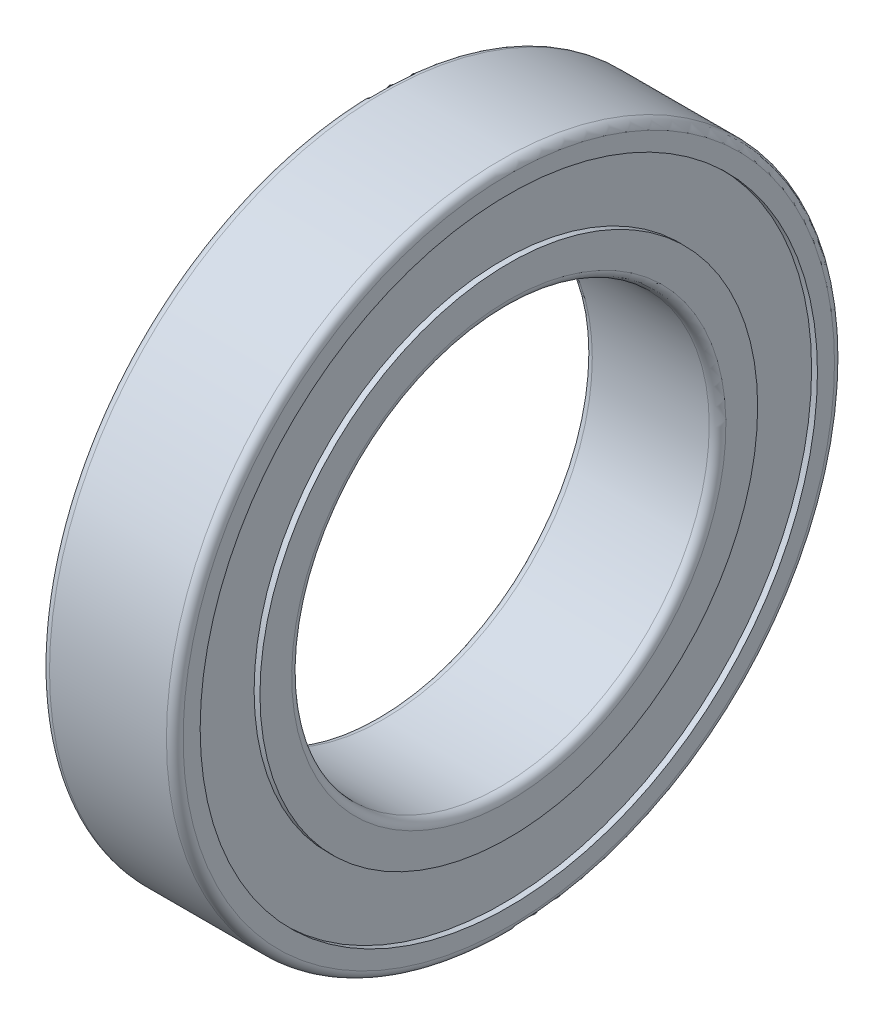
ISO-10303-21;
HEADER;
FILE_DESCRIPTION(('STEP AP214'),'2;1');
FILE_NAME('part.step','',(''),(''),'','','');
FILE_SCHEMA(('AUTOMOTIVE_DESIGN { 1 0 10303 214 1 1 1 1 }'));
ENDSEC;
DATA;
#1=APPLICATION_CONTEXT('core data for automotive mechanical design processes');
#2=APPLICATION_PROTOCOL_DEFINITION('international standard','automotive_design',2000,#1);
#3=PRODUCT_CONTEXT('',#1,'mechanical');
#4=PRODUCT('Part','Part','',(#3));
#5=PRODUCT_RELATED_PRODUCT_CATEGORY('part','',(#4));
#6=PRODUCT_DEFINITION_FORMATION('','',#4);
#7=PRODUCT_DEFINITION_CONTEXT('part definition',#1,'design');
#8=PRODUCT_DEFINITION('design','',#6,#7);
#9=PRODUCT_DEFINITION_SHAPE('','',#8);
#10=(LENGTH_UNIT() NAMED_UNIT(*) SI_UNIT(.MILLI.,.METRE.));
#11=(NAMED_UNIT(*) PLANE_ANGLE_UNIT() SI_UNIT($,.RADIAN.));
#12=(NAMED_UNIT(*) SI_UNIT($,.STERADIAN.) SOLID_ANGLE_UNIT());
#13=UNCERTAINTY_MEASURE_WITH_UNIT(LENGTH_MEASURE(1.E-05),#10,'distance_accuracy_value','');
#14=(GEOMETRIC_REPRESENTATION_CONTEXT(3) GLOBAL_UNCERTAINTY_ASSIGNED_CONTEXT((#13)) GLOBAL_UNIT_ASSIGNED_CONTEXT((#10,
#11,#12)) REPRESENTATION_CONTEXT('',''));
#15=CARTESIAN_POINT('',(0.,0.,0.));
#16=DIRECTION('',(0.,0.,1.));
#17=DIRECTION('',(1.,0.,0.));
#18=AXIS2_PLACEMENT_3D('',#15,#16,#17);
#19=CARTESIAN_POINT('',(16.,0.,0.));
#20=DIRECTION('',(-1.,0.,0.));
#21=DIRECTION('',(0.,0.,1.));
#22=AXIS2_PLACEMENT_3D('',#19,#20,#21);
#23=CYLINDRICAL_SURFACE('',#22,25.);
#24=CARTESIAN_POINT('',(0.999999999999999,0.,0.));
#25=DIRECTION('',(1.,0.,0.));
#26=DIRECTION('',(0.,0.,-1.));
#27=AXIS2_PLACEMENT_3D('',#24,#25,#26);
#28=CIRCLE('',#27,25.);
#29=CARTESIAN_POINT('',(0.999999999999999,0.,-25.));
#30=VERTEX_POINT('',#29);
#31=EDGE_CURVE('E30',#30,#30,#28,.T.);
#32=ORIENTED_EDGE('',*,*,#31,.F.);
#33=EDGE_LOOP('',(#32));
#34=FACE_BOUND('',#33,.T.);
#35=CARTESIAN_POINT('',(15.,0.,0.));
#36=DIRECTION('',(-1.,0.,0.));
#37=DIRECTION('',(0.,-1.,0.));
#38=AXIS2_PLACEMENT_3D('',#35,#36,#37);
#39=CIRCLE('',#38,25.);
#40=CARTESIAN_POINT('',(15.,-25.,0.));
#41=VERTEX_POINT('',#40);
#42=EDGE_CURVE('E33',#41,#41,#39,.T.);
#43=ORIENTED_EDGE('',*,*,#42,.F.);
#44=EDGE_LOOP('',(#43));
#45=FACE_BOUND('',#44,.T.);
#46=ADVANCED_FACE('F14',(#34,#45),#23,.F.);
#47=CARTESIAN_POINT('',(15.,0.,0.));
#48=DIRECTION('',(1.,0.,0.));
#49=DIRECTION('',(0.,1.,0.));
#50=AXIS2_PLACEMENT_3D('',#47,#48,#49);
#51=TOROIDAL_SURFACE('',#50,26.,1.);
#52=ORIENTED_EDGE('',*,*,#42,.T.);
#53=EDGE_LOOP('',(#52));
#54=FACE_BOUND('',#53,.T.);
#55=CARTESIAN_POINT('',(16.,0.,0.));
#56=DIRECTION('',(1.,0.,0.));
#57=DIRECTION('',(0.,1.,0.));
#58=AXIS2_PLACEMENT_3D('',#55,#56,#57);
#59=CIRCLE('',#58,26.);
#60=CARTESIAN_POINT('',(16.,26.,0.));
#61=VERTEX_POINT('',#60);
#62=EDGE_CURVE('E18',#61,#61,#59,.F.);
#63=ORIENTED_EDGE('',*,*,#62,.F.);
#64=EDGE_LOOP('',(#63));
#65=FACE_BOUND('',#64,.T.);
#66=ADVANCED_FACE('F73',(#54,#65),#51,.T.);
#67=CARTESIAN_POINT('',(0.999999999999993,0.,0.));
#68=DIRECTION('',(1.,0.,0.));
#69=DIRECTION('',(0.,0.,-1.));
#70=AXIS2_PLACEMENT_3D('',#67,#68,#69);
#71=TOROIDAL_SURFACE('',#70,26.,0.999999999999999);
#72=ORIENTED_EDGE('',*,*,#31,.T.);
#73=EDGE_LOOP('',(#72));
#74=FACE_BOUND('',#73,.T.);
#75=CARTESIAN_POINT('',(0.,0.,0.));
#76=DIRECTION('',(1.,0.,0.));
#77=DIRECTION('',(0.,0.,-1.));
#78=AXIS2_PLACEMENT_3D('',#75,#76,#77);
#79=CIRCLE('',#78,26.);
#80=CARTESIAN_POINT('',(0.,0.,-26.));
#81=VERTEX_POINT('',#80);
#82=EDGE_CURVE('E64',#81,#81,#79,.T.);
#83=ORIENTED_EDGE('',*,*,#82,.F.);
#84=EDGE_LOOP('',(#83));
#85=FACE_BOUND('',#84,.T.);
#86=ADVANCED_FACE('F75',(#74,#85),#71,.T.);
#87=CARTESIAN_POINT('',(16.,26.,0.));
#88=DIRECTION('',(1.,0.,0.));
#89=DIRECTION('',(0.,0.,-1.));
#90=AXIS2_PLACEMENT_3D('',#87,#88,#89);
#91=PLANE('',#90);
#92=CARTESIAN_POINT('',(16.,0.,0.));
#93=DIRECTION('',(-1.,0.,0.));
#94=DIRECTION('',(0.,0.,1.));
#95=AXIS2_PLACEMENT_3D('',#92,#93,#94);
#96=CIRCLE('',#95,29.8);
#97=CARTESIAN_POINT('',(16.,0.,29.8));
#98=VERTEX_POINT('',#97);
#99=EDGE_CURVE('E62',#98,#98,#96,.T.);
#100=ORIENTED_EDGE('',*,*,#99,.F.);
#101=EDGE_LOOP('',(#100));
#102=FACE_BOUND('',#101,.T.);
#103=ORIENTED_EDGE('',*,*,#62,.T.);
#104=EDGE_LOOP('',(#103));
#105=FACE_BOUND('',#104,.T.);
#106=ADVANCED_FACE('F71',(#102,#105),#91,.T.);
#107=CARTESIAN_POINT('',(0.,29.8,0.));
#108=DIRECTION('',(-1.,0.,0.));
#109=DIRECTION('',(0.,0.,1.));
#110=AXIS2_PLACEMENT_3D('',#107,#108,#109);
#111=PLANE('',#110);
#112=ORIENTED_EDGE('',*,*,#82,.T.);
#113=EDGE_LOOP('',(#112));
#114=FACE_BOUND('',#113,.T.);
#115=CARTESIAN_POINT('',(0.,0.,0.));
#116=DIRECTION('',(-1.,0.,0.));
#117=DIRECTION('',(0.,0.,1.));
#118=AXIS2_PLACEMENT_3D('',#115,#116,#117);
#119=CIRCLE('',#118,29.8);
#120=CARTESIAN_POINT('',(0.,0.,29.8));
#121=VERTEX_POINT('',#120);
#122=EDGE_CURVE('E59',#121,#121,#119,.F.);
#123=ORIENTED_EDGE('',*,*,#122,.F.);
#124=EDGE_LOOP('',(#123));
#125=FACE_BOUND('',#124,.T.);
#126=ADVANCED_FACE('F128',(#114,#125),#111,.T.);
#127=CARTESIAN_POINT('',(16.,0.,0.));
#128=DIRECTION('',(-1.,0.,0.));
#129=DIRECTION('',(0.,0.,1.));
#130=AXIS2_PLACEMENT_3D('',#127,#128,#129);
#131=CYLINDRICAL_SURFACE('',#130,29.8);
#132=ORIENTED_EDGE('',*,*,#99,.T.);
#133=EDGE_LOOP('',(#132));
#134=FACE_BOUND('',#133,.T.);
#135=CARTESIAN_POINT('',(15.3,0.,0.));
#136=DIRECTION('',(-1.,0.,0.));
#137=DIRECTION('',(0.,0.,1.));
#138=AXIS2_PLACEMENT_3D('',#135,#136,#137);
#139=CIRCLE('',#138,29.8);
#140=CARTESIAN_POINT('',(15.3,0.,29.8));
#141=VERTEX_POINT('',#140);
#142=EDGE_CURVE('E56',#141,#141,#139,.T.);
#143=ORIENTED_EDGE('',*,*,#142,.F.);
#144=EDGE_LOOP('',(#143));
#145=FACE_BOUND('',#144,.T.);
#146=ADVANCED_FACE('F124',(#134,#145),#131,.T.);
#147=CARTESIAN_POINT('',(16.,0.,0.));
#148=DIRECTION('',(-1.,0.,0.));
#149=DIRECTION('',(0.,0.,1.));
#150=AXIS2_PLACEMENT_3D('',#147,#148,#149);
#151=CYLINDRICAL_SURFACE('',#150,29.8);
#152=ORIENTED_EDGE('',*,*,#122,.T.);
#153=EDGE_LOOP('',(#152));
#154=FACE_BOUND('',#153,.T.);
#155=CARTESIAN_POINT('',(0.700000000000001,0.,0.));
#156=DIRECTION('',(-1.,0.,0.));
#157=DIRECTION('',(0.,0.,1.));
#158=AXIS2_PLACEMENT_3D('',#155,#156,#157);
#159=CIRCLE('',#158,29.8);
#160=CARTESIAN_POINT('',(0.700000000000001,0.,29.8));
#161=VERTEX_POINT('',#160);
#162=EDGE_CURVE('E53',#161,#161,#159,.F.);
#163=ORIENTED_EDGE('',*,*,#162,.F.);
#164=EDGE_LOOP('',(#163));
#165=FACE_BOUND('',#164,.T.);
#166=ADVANCED_FACE('F120',(#154,#165),#151,.T.);
#167=CARTESIAN_POINT('',(15.3,29.8,0.));
#168=DIRECTION('',(1.,0.,0.));
#169=DIRECTION('',(0.,0.,-1.));
#170=AXIS2_PLACEMENT_3D('',#167,#168,#169);
#171=PLANE('',#170);
#172=CARTESIAN_POINT('',(15.3,0.,0.));
#173=DIRECTION('',(-1.,0.,0.));
#174=DIRECTION('',(0.,0.,1.));
#175=AXIS2_PLACEMENT_3D('',#172,#173,#174);
#176=CIRCLE('',#175,36.96);
#177=CARTESIAN_POINT('',(15.3,0.,36.96));
#178=VERTEX_POINT('',#177);
#179=EDGE_CURVE('E50',#178,#178,#176,.F.);
#180=ORIENTED_EDGE('',*,*,#179,.T.);
#181=EDGE_LOOP('',(#180));
#182=FACE_BOUND('',#181,.T.);
#183=ORIENTED_EDGE('',*,*,#142,.T.);
#184=EDGE_LOOP('',(#183));
#185=FACE_BOUND('',#184,.T.);
#186=ADVANCED_FACE('F116',(#182,#185),#171,.T.);
#187=CARTESIAN_POINT('',(0.7,36.96,0.));
#188=DIRECTION('',(-1.,0.,0.));
#189=DIRECTION('',(0.,0.,1.));
#190=AXIS2_PLACEMENT_3D('',#187,#188,#189);
#191=PLANE('',#190);
#192=ORIENTED_EDGE('',*,*,#162,.T.);
#193=EDGE_LOOP('',(#192));
#194=FACE_BOUND('',#193,.T.);
#195=CARTESIAN_POINT('',(0.700000000000001,0.,0.));
#196=DIRECTION('',(-1.,0.,0.));
#197=DIRECTION('',(0.,0.,1.));
#198=AXIS2_PLACEMENT_3D('',#195,#196,#197);
#199=CIRCLE('',#198,36.96);
#200=CARTESIAN_POINT('',(0.700000000000001,0.,36.96));
#201=VERTEX_POINT('',#200);
#202=EDGE_CURVE('E47',#201,#201,#199,.T.);
#203=ORIENTED_EDGE('',*,*,#202,.T.);
#204=EDGE_LOOP('',(#203));
#205=FACE_BOUND('',#204,.T.);
#206=ADVANCED_FACE('F112',(#194,#205),#191,.T.);
#207=CARTESIAN_POINT('',(16.,0.,0.));
#208=DIRECTION('',(-1.,0.,0.));
#209=DIRECTION('',(0.,0.,1.));
#210=AXIS2_PLACEMENT_3D('',#207,#208,#209);
#211=CYLINDRICAL_SURFACE('',#210,36.96);
#212=ORIENTED_EDGE('',*,*,#179,.F.);
#213=EDGE_LOOP('',(#212));
#214=FACE_BOUND('',#213,.T.);
#215=CARTESIAN_POINT('',(16.,0.,0.));
#216=DIRECTION('',(-1.,0.,0.));
#217=DIRECTION('',(0.,0.,1.));
#218=AXIS2_PLACEMENT_3D('',#215,#216,#217);
#219=CIRCLE('',#218,36.96);
#220=CARTESIAN_POINT('',(16.,0.,36.96));
#221=VERTEX_POINT('',#220);
#222=EDGE_CURVE('E44',#221,#221,#219,.T.);
#223=ORIENTED_EDGE('',*,*,#222,.F.);
#224=EDGE_LOOP('',(#223));
#225=FACE_BOUND('',#224,.T.);
#226=ADVANCED_FACE('F108',(#214,#225),#211,.F.);
#227=CARTESIAN_POINT('',(16.,0.,0.));
#228=DIRECTION('',(-1.,0.,0.));
#229=DIRECTION('',(0.,0.,1.));
#230=AXIS2_PLACEMENT_3D('',#227,#228,#229);
#231=CYLINDRICAL_SURFACE('',#230,36.96);
#232=ORIENTED_EDGE('',*,*,#202,.F.);
#233=EDGE_LOOP('',(#232));
#234=FACE_BOUND('',#233,.T.);
#235=CARTESIAN_POINT('',(0.,0.,0.));
#236=DIRECTION('',(-1.,0.,0.));
#237=DIRECTION('',(0.,0.,1.));
#238=AXIS2_PLACEMENT_3D('',#235,#236,#237);
#239=CIRCLE('',#238,36.96);
#240=CARTESIAN_POINT('',(0.,0.,36.96));
#241=VERTEX_POINT('',#240);
#242=EDGE_CURVE('E41',#241,#241,#239,.F.);
#243=ORIENTED_EDGE('',*,*,#242,.F.);
#244=EDGE_LOOP('',(#243));
#245=FACE_BOUND('',#244,.T.);
#246=ADVANCED_FACE('F104',(#234,#245),#231,.F.);
#247=CARTESIAN_POINT('',(16.,36.96,0.));
#248=DIRECTION('',(1.,0.,0.));
#249=DIRECTION('',(0.,0.,-1.));
#250=AXIS2_PLACEMENT_3D('',#247,#248,#249);
#251=PLANE('',#250);
#252=CARTESIAN_POINT('',(16.,0.,0.));
#253=DIRECTION('',(1.,0.,0.));
#254=DIRECTION('',(0.,0.,-1.));
#255=AXIS2_PLACEMENT_3D('',#252,#253,#254);
#256=CIRCLE('',#255,39.);
#257=CARTESIAN_POINT('',(16.,0.,-39.));
#258=VERTEX_POINT('',#257);
#259=EDGE_CURVE('E38',#258,#258,#256,.F.);
#260=ORIENTED_EDGE('',*,*,#259,.F.);
#261=EDGE_LOOP('',(#260));
#262=FACE_BOUND('',#261,.T.);
#263=ORIENTED_EDGE('',*,*,#222,.T.);
#264=EDGE_LOOP('',(#263));
#265=FACE_BOUND('',#264,.T.);
#266=ADVANCED_FACE('F100',(#262,#265),#251,.T.);
#267=CARTESIAN_POINT('',(0.,39.,0.));
#268=DIRECTION('',(-1.,0.,0.));
#269=DIRECTION('',(0.,0.,1.));
#270=AXIS2_PLACEMENT_3D('',#267,#268,#269);
#271=PLANE('',#270);
#272=ORIENTED_EDGE('',*,*,#242,.T.);
#273=EDGE_LOOP('',(#272));
#274=FACE_BOUND('',#273,.T.);
#275=CARTESIAN_POINT('',(0.,0.,0.));
#276=DIRECTION('',(1.,0.,0.));
#277=DIRECTION('',(0.,0.,-1.));
#278=AXIS2_PLACEMENT_3D('',#275,#276,#277);
#279=CIRCLE('',#278,39.);
#280=CARTESIAN_POINT('',(0.,0.,-39.));
#281=VERTEX_POINT('',#280);
#282=EDGE_CURVE('E27',#281,#281,#279,.T.);
#283=ORIENTED_EDGE('',*,*,#282,.F.);
#284=EDGE_LOOP('',(#283));
#285=FACE_BOUND('',#284,.T.);
#286=ADVANCED_FACE('F97',(#274,#285),#271,.T.);
#287=CARTESIAN_POINT('',(15.,0.,0.));
#288=DIRECTION('',(1.,0.,0.));
#289=DIRECTION('',(0.,0.,-1.));
#290=AXIS2_PLACEMENT_3D('',#287,#288,#289);
#291=TOROIDAL_SURFACE('',#290,39.,1.);
#292=ORIENTED_EDGE('',*,*,#259,.T.);
#293=EDGE_LOOP('',(#292));
#294=FACE_BOUND('',#293,.T.);
#295=CARTESIAN_POINT('',(15.,0.,0.));
#296=DIRECTION('',(-1.,0.,0.));
#297=DIRECTION('',(0.,0.,1.));
#298=AXIS2_PLACEMENT_3D('',#295,#296,#297);
#299=CIRCLE('',#298,40.);
#300=CARTESIAN_POINT('',(15.,0.,40.));
#301=VERTEX_POINT('',#300);
#302=EDGE_CURVE('E22',#301,#301,#299,.T.);
#303=ORIENTED_EDGE('',*,*,#302,.F.);
#304=EDGE_LOOP('',(#303));
#305=FACE_BOUND('',#304,.T.);
#306=ADVANCED_FACE('F93',(#294,#305),#291,.T.);
#307=CARTESIAN_POINT('',(1.00000000000001,0.,0.));
#308=DIRECTION('',(1.,0.,0.));
#309=DIRECTION('',(0.,0.,-1.));
#310=AXIS2_PLACEMENT_3D('',#307,#308,#309);
#311=TOROIDAL_SURFACE('',#310,39.,1.);
#312=CARTESIAN_POINT('',(1.,0.,0.));
#313=DIRECTION('',(-1.,0.,0.));
#314=DIRECTION('',(0.,0.,1.));
#315=AXIS2_PLACEMENT_3D('',#312,#313,#314);
#316=CIRCLE('',#315,40.);
#317=CARTESIAN_POINT('',(1.,0.,40.));
#318=VERTEX_POINT('',#317);
#319=EDGE_CURVE('E10',#318,#318,#316,.F.);
#320=ORIENTED_EDGE('',*,*,#319,.F.);
#321=EDGE_LOOP('',(#320));
#322=FACE_BOUND('',#321,.T.);
#323=ORIENTED_EDGE('',*,*,#282,.T.);
#324=EDGE_LOOP('',(#323));
#325=FACE_BOUND('',#324,.T.);
#326=ADVANCED_FACE('F16',(#322,#325),#311,.T.);
#327=CARTESIAN_POINT('',(16.,0.,0.));
#328=DIRECTION('',(-1.,0.,0.));
#329=DIRECTION('',(0.,0.,1.));
#330=AXIS2_PLACEMENT_3D('',#327,#328,#329);
#331=CYLINDRICAL_SURFACE('',#330,40.);
#332=ORIENTED_EDGE('',*,*,#319,.T.);
#333=EDGE_LOOP('',(#332));
#334=FACE_BOUND('',#333,.T.);
#335=ORIENTED_EDGE('',*,*,#302,.T.);
#336=EDGE_LOOP('',(#335));
#337=FACE_BOUND('',#336,.T.);
#338=ADVANCED_FACE('F87',(#334,#337),#331,.T.);
#339=CLOSED_SHELL('',(#46,#66,#86,#106,#126,#146,#166,#186,#206,#226,#246,#266,#286,#306,#326,#338));
#340=MANIFOLD_SOLID_BREP('B1',#339);
#341=ADVANCED_BREP_SHAPE_REPRESENTATION('',(#18,#340),#14);
#342=SHAPE_DEFINITION_REPRESENTATION(#9,#341);
ENDSEC;
END-ISO-10303-21;
